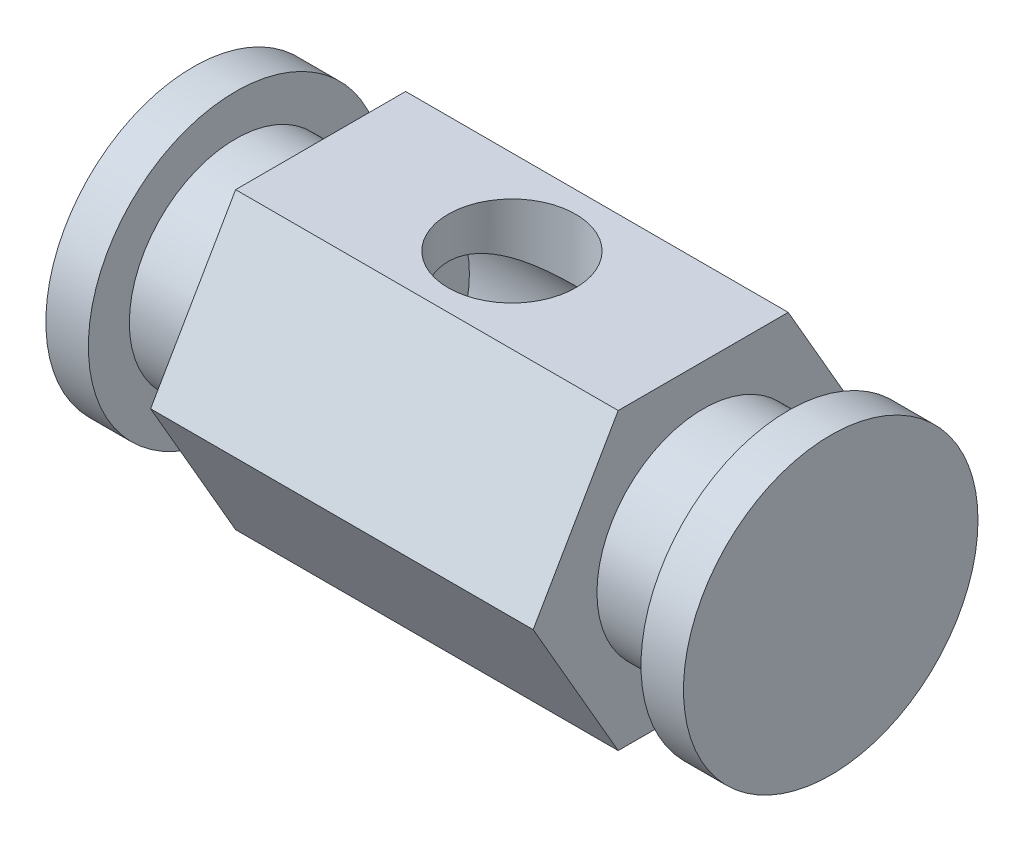
ISO-10303-21;
HEADER;
FILE_DESCRIPTION(('STEP AP214'),'2;1');
FILE_NAME('part.step','',(''),(''),'','','');
FILE_SCHEMA(('AUTOMOTIVE_DESIGN { 1 0 10303 214 1 1 1 1 }'));
ENDSEC;
DATA;
#1=APPLICATION_CONTEXT('core data for automotive mechanical design processes');
#2=APPLICATION_PROTOCOL_DEFINITION('international standard','automotive_design',2000,#1);
#3=PRODUCT_CONTEXT('',#1,'mechanical');
#4=PRODUCT('Part','Part','',(#3));
#5=PRODUCT_RELATED_PRODUCT_CATEGORY('part','',(#4));
#6=PRODUCT_DEFINITION_FORMATION('','',#4);
#7=PRODUCT_DEFINITION_CONTEXT('part definition',#1,'design');
#8=PRODUCT_DEFINITION('design','',#6,#7);
#9=PRODUCT_DEFINITION_SHAPE('','',#8);
#10=(LENGTH_UNIT() NAMED_UNIT(*) SI_UNIT(.MILLI.,.METRE.));
#11=(NAMED_UNIT(*) PLANE_ANGLE_UNIT() SI_UNIT($,.RADIAN.));
#12=(NAMED_UNIT(*) SI_UNIT($,.STERADIAN.) SOLID_ANGLE_UNIT());
#13=UNCERTAINTY_MEASURE_WITH_UNIT(LENGTH_MEASURE(1.E-05),#10,'distance_accuracy_value','');
#14=(GEOMETRIC_REPRESENTATION_CONTEXT(3) GLOBAL_UNCERTAINTY_ASSIGNED_CONTEXT((#13)) GLOBAL_UNIT_ASSIGNED_CONTEXT((#10,
#11,#12)) REPRESENTATION_CONTEXT('',''));
#15=CARTESIAN_POINT('',(0.,0.,0.));
#16=DIRECTION('',(0.,0.,1.));
#17=DIRECTION('',(1.,0.,0.));
#18=AXIS2_PLACEMENT_3D('',#15,#16,#17);
#19=CARTESIAN_POINT('',(22.5,0.,0.));
#20=DIRECTION('',(-1.,0.,0.));
#21=DIRECTION('',(0.,0.,1.));
#22=AXIS2_PLACEMENT_3D('',#19,#20,#21);
#23=CYLINDRICAL_SURFACE('',#22,12.5);
#24=CARTESIAN_POINT('',(17.5,0.,0.));
#25=DIRECTION('',(1.,0.,0.));
#26=DIRECTION('',(0.,0.,-1.));
#27=AXIS2_PLACEMENT_3D('',#24,#25,#26);
#28=CIRCLE('',#27,12.5);
#29=CARTESIAN_POINT('',(17.5,0.,-12.5));
#30=VERTEX_POINT('',#29);
#31=EDGE_CURVE('E210',#30,#30,#28,.T.);
#32=ORIENTED_EDGE('',*,*,#31,.T.);
#33=EDGE_LOOP('',(#32));
#34=FACE_BOUND('',#33,.T.);
#35=CARTESIAN_POINT('',(0.,-10.,7.5));
#36=CARTESIAN_POINT('',(0.188692773104688,-9.99999823078383,7.50000120679242));
#37=CARTESIAN_POINT('',(0.377372231482413,-10.0053601477454,7.49286874148265));
#38=CARTESIAN_POINT('',(0.753055741609481,-10.0265610634639,7.46447502665632));
#39=CARTESIAN_POINT('',(0.940059904060489,-10.0423993646996,7.44321471777582));
#40=CARTESIAN_POINT('',(1.31103429157001,-10.0838875511475,7.38690918482064));
#41=CARTESIAN_POINT('',(1.49500158372569,-10.1095464015261,7.35185136418562));
#42=CARTESIAN_POINT('',(1.85843271331336,-10.1696429705428,7.26849331083707));
#43=CARTESIAN_POINT('',(2.0378963147779,-10.2040811481166,7.22019238583577));
#44=CARTESIAN_POINT('',(2.38994614713429,-10.2802003218269,7.11138858218429));
#45=CARTESIAN_POINT('',(2.56257402518394,-10.3218247593381,7.05098043543781));
#46=CARTESIAN_POINT('',(2.90163367268208,-10.4111819148763,6.9183586416477));
#47=CARTESIAN_POINT('',(3.06806298347129,-10.4589170240795,6.84614037008011));
#48=CARTESIAN_POINT('',(3.5570088898786,-10.6092473794473,6.61272201077553));
#49=CARTESIAN_POINT('',(3.86941771930208,-10.7190214536722,6.43468492430838));
#50=CARTESIAN_POINT('',(4.49983310186811,-10.961457844936,6.01351023928956));
#51=CARTESIAN_POINT('',(4.81385372032728,-11.0952775973879,5.76507448644969));
#52=CARTESIAN_POINT('',(5.25250928504391,-11.2947767726125,5.35733763463461));
#53=CARTESIAN_POINT('',(5.39341905252056,-11.3611173580496,5.21546669500758));
#54=CARTESIAN_POINT('',(5.66389561288898,-11.4919832543935,4.92039993723567));
#55=CARTESIAN_POINT('',(5.79346040775826,-11.5565082441938,4.76720213298469));
#56=CARTESIAN_POINT('',(6.05387736830032,-11.6891210188159,4.43285564137838));
#57=CARTESIAN_POINT('',(6.18334510449195,-11.7568362139061,4.25047753744622));
#58=CARTESIAN_POINT('',(6.42623807951091,-11.8863782053003,3.87346312854206));
#59=CARTESIAN_POINT('',(6.53967045659397,-11.9482076176741,3.67883233406749));
#60=CARTESIAN_POINT('',(6.74929824514343,-12.0642201883362,3.2784164671804));
#61=CARTESIAN_POINT('',(6.84550107726848,-12.1184066362557,3.07263624673865));
#62=CARTESIAN_POINT('',(7.01944969456585,-12.2175104392727,2.65127326533902));
#63=CARTESIAN_POINT('',(7.0971985128734,-12.2624293174459,2.43569212222876));
#64=CARTESIAN_POINT('',(7.2265508104083,-12.3377691728578,2.01747359212342));
#65=CARTESIAN_POINT('',(7.27994111935902,-12.3691645244113,1.81556383007454));
#66=CARTESIAN_POINT('',(7.36985691367482,-12.4222973608661,1.40676725051505));
#67=CARTESIAN_POINT('',(7.40638337680498,-12.4440354056949,1.19988072228908));
#68=CARTESIAN_POINT('',(7.46196289662482,-12.477194920202,0.783116791483749));
#69=CARTESIAN_POINT('',(7.48102963470044,-12.4886244674807,0.573241861806046));
#70=CARTESIAN_POINT('',(7.50141157120872,-12.5008442041257,0.152330680482684));
#71=CARTESIAN_POINT('',(7.50272857571368,-12.5016354759586,-0.0587054508221876));
#72=CARTESIAN_POINT('',(7.48853906892484,-12.4931260267531,-0.453714777156578));
#73=CARTESIAN_POINT('',(7.47510185603572,-12.4850666053635,-0.637793616435806));
#74=CARTESIAN_POINT('',(7.43478376412771,-12.4609689355091,-1.00394655598314));
#75=CARTESIAN_POINT('',(7.40790295021372,-12.4449307256842,-1.18602066595543));
#76=CARTESIAN_POINT('',(7.3410358323648,-12.4052442277447,-1.54689074708866));
#77=CARTESIAN_POINT('',(7.30104970200605,-12.3815960404222,-1.72568676163393));
#78=CARTESIAN_POINT('',(7.20844210361948,-12.3272151907499,-2.07886939421951));
#79=CARTESIAN_POINT('',(7.155820114962,-12.2964822364917,-2.25325583024659));
#80=CARTESIAN_POINT('',(7.03817333792658,-12.2283918721564,-2.59757407732022));
#81=CARTESIAN_POINT('',(6.97308161624169,-12.1909987925766,-2.76747594566571));
#82=CARTESIAN_POINT('',(6.83130799278641,-12.1104656177526,-3.10098446114959));
#83=CARTESIAN_POINT('',(6.7546222287775,-12.0673236079794,-3.26458898762978));
#84=CARTESIAN_POINT('',(6.50814521196327,-11.9305144973489,-3.74477506801769));
#85=CARTESIAN_POINT('',(6.3218550439595,-11.8294173233651,-4.05095816681986));
#86=CARTESIAN_POINT('',(5.88579358864849,-11.6018914143767,-4.66541618539828));
#87=CARTESIAN_POINT('',(5.63109761876534,-11.4738793152295,-4.9695726070298));
#88=CARTESIAN_POINT('',(5.07794018109779,-11.2127575101819,-5.5335940307367));
#89=CARTESIAN_POINT('',(4.77941947736904,-11.0796410878055,-5.7933980391173));
#90=CARTESIAN_POINT('',(4.28409925606161,-10.8778361830914,-6.15997312633097));
#91=CARTESIAN_POINT('',(4.10058958896489,-10.8066538673819,-6.28366126969308));
#92=CARTESIAN_POINT('',(3.72202575670407,-10.6687579062864,-6.51503745890077));
#93=CARTESIAN_POINT('',(3.52696970058253,-10.602044996692,-6.62272287377845));
#94=CARTESIAN_POINT('',(3.12652125290092,-10.4756432504103,-6.82090231570387));
#95=CARTESIAN_POINT('',(2.92114494481455,-10.4159439402154,-6.91142210385062));
#96=CARTESIAN_POINT('',(2.50090829012674,-10.305992775228,-7.07433274728352));
#97=CARTESIAN_POINT('',(2.28605170832038,-10.2557372111069,-7.14673072420734));
#98=CARTESIAN_POINT('',(1.90263340778911,-10.178114111283,-7.25667461828035));
#99=CARTESIAN_POINT('',(1.73578617557886,-10.1481606268142,-7.29841140631324));
#100=CARTESIAN_POINT('',(1.39847645342368,-10.0959398034874,-7.37048077339704));
#101=CARTESIAN_POINT('',(1.22801477044022,-10.0736707677861,-7.40081587024739));
#102=CARTESIAN_POINT('',(0.88467910293567,-10.037606550335,-7.44965633189382));
#103=CARTESIAN_POINT('',(0.711807598531673,-10.0238032320233,-7.4681730562511));
#104=CARTESIAN_POINT('',(0.364704061930949,-10.0051477481708,-7.49314782944574));
#105=CARTESIAN_POINT('',(0.190472000959253,-10.0002957724635,-7.4996056225464));
#106=CARTESIAN_POINT('',(-0.158273249010935,-9.99973014508067,-7.50035982068346));
#107=CARTESIAN_POINT('',(-0.332786495033985,-10.0040290732705,-7.49463948428721));
#108=CARTESIAN_POINT('',(-0.680531944099266,-10.0216248303757,-7.47109423447713));
#109=CARTESIAN_POINT('',(-0.853764140464238,-10.034921706158,-7.45326925801477));
#110=CARTESIAN_POINT('',(-1.1977974129686,-10.0700255654224,-7.40577159941338));
#111=CARTESIAN_POINT('',(-1.36859727685108,-10.0918366483772,-7.37609320986082));
#112=CARTESIAN_POINT('',(-1.70667432339135,-10.1432145107887,-7.30527949826134));
#113=CARTESIAN_POINT('',(-1.8739500378864,-10.172784456172,-7.26413949899432));
#114=CARTESIAN_POINT('',(-2.20374031188016,-10.2386720947097,-7.17097191379845));
#115=CARTESIAN_POINT('',(-2.36626272005138,-10.274977841261,-7.1189635835979));
#116=CARTESIAN_POINT('',(-2.68619223147815,-10.3533352508685,-7.00451682931186));
#117=CARTESIAN_POINT('',(-2.8435976378413,-10.3953887964191,-6.94207498659024));
#118=CARTESIAN_POINT('',(-3.30723467778529,-10.5285418463914,-6.73987072741965));
#119=CARTESIAN_POINT('',(-3.60504547886708,-10.6266672038671,-6.58518422132203));
#120=CARTESIAN_POINT('',(-4.22628250436646,-10.8518645415799,-6.20832715462771));
#121=CARTESIAN_POINT('',(-4.54464774892117,-10.9809658731543,-5.9790180424004));
#122=CARTESIAN_POINT('',(-4.99214330661705,-11.1760249043361,-5.60060254239724));
#123=CARTESIAN_POINT('',(-5.13640074272676,-11.2413306806479,-5.46860539765543));
#124=CARTESIAN_POINT('',(-5.41443062347967,-11.3710562458251,-5.19347495646691));
#125=CARTESIAN_POINT('',(-5.54820120771097,-11.4354758758204,-5.05033969300513));
#126=CARTESIAN_POINT('',(-5.82131514437674,-11.5702992750371,-4.73407411681794));
#127=CARTESIAN_POINT('',(-5.95910849863414,-11.6403872249459,-4.55946685321339));
#128=CARTESIAN_POINT('',(-6.21936179384066,-11.7757426572854,-4.19752243251675));
#129=CARTESIAN_POINT('',(-6.34182793854949,-11.8410120856195,-4.01019047347924));
#130=CARTESIAN_POINT('',(-6.57031577035696,-11.9649421100263,-3.62371710093581));
#131=CARTESIAN_POINT('',(-6.67634116026973,-12.0236041933995,-3.4245783605802));
#132=CARTESIAN_POINT('',(-6.87072708731596,-12.1326177402039,-3.0156810985293));
#133=CARTESIAN_POINT('',(-6.95909003276554,-12.1829703364898,-2.80592402956304));
#134=CARTESIAN_POINT('',(-7.1111773112232,-12.2705038668088,-2.39290771317297));
#135=CARTESIAN_POINT('',(-7.17622475903736,-12.308375712443,-2.19028248858964));
#136=CARTESIAN_POINT('',(-7.28913769564021,-12.3745477559289,-1.778758838461));
#137=CARTESIAN_POINT('',(-7.3370038235628,-12.4028483098242,-1.56986064657932));
#138=CARTESIAN_POINT('',(-7.41475182068993,-12.4489985951498,-1.14780479520938));
#139=CARTESIAN_POINT('',(-7.44465062820149,-12.4668581691577,-0.934651343809274));
#140=CARTESIAN_POINT('',(-7.48601236995236,-12.4916012697912,-0.505939659922356));
#141=CARTESIAN_POINT('',(-7.49747770748443,-12.4984862272487,-0.290381744611884));
#142=CARTESIAN_POINT('',(-7.50149083731495,-12.5008948532131,0.112151821569249));
#143=CARTESIAN_POINT('',(-7.49635999809251,-12.4978126770678,0.299101086082838));
#144=CARTESIAN_POINT('',(-7.47218709467063,-12.4833282510086,0.671773742150895));
#145=CARTESIAN_POINT('',(-7.45314537944419,-12.4719262098097,0.857497164339332));
#146=CARTESIAN_POINT('',(-7.40140400507448,-12.4410751634198,1.22633646290172));
#147=CARTESIAN_POINT('',(-7.36870500971334,-12.4216265493153,1.40945246555634));
#148=CARTESIAN_POINT('',(-7.29006169982175,-12.3751361717483,1.77183006760248));
#149=CARTESIAN_POINT('',(-7.24411698832095,-12.3480941807152,1.9510915513021));
#150=CARTESIAN_POINT('',(-7.14036425079735,-12.2875162258367,2.30175557439519));
#151=CARTESIAN_POINT('',(-7.08276181686451,-12.2540933057182,2.47323858855957));
#152=CARTESIAN_POINT('',(-6.95583265831419,-12.1811708599912,2.81049732306679));
#153=CARTESIAN_POINT('',(-6.88650213772686,-12.1416693673375,2.97627117457875));
#154=CARTESIAN_POINT('',(-6.66186004706047,-12.0151967745144,3.46373719515787));
#155=CARTESIAN_POINT('',(-6.48982400648675,-11.9202132953099,3.7758204727761));
#156=CARTESIAN_POINT('',(-6.08534983857752,-11.7046609545403,4.401374151397));
#157=CARTESIAN_POINT('',(-5.84838193641815,-11.5824339466914,4.7113171053629));
#158=CARTESIAN_POINT('',(-5.33125937723798,-11.3301036620341,5.28946389728756));
#159=CARTESIAN_POINT('',(-5.05105687747664,-11.1999917579732,5.55762082660486));
#160=CARTESIAN_POINT('',(-4.41348879871702,-10.9263829364944,6.07959239913489));
#161=CARTESIAN_POINT('',(-4.05084402361769,-10.7832810292532,6.32727585963683));
#162=CARTESIAN_POINT('',(-3.47462714205365,-10.5849217173034,6.65022773867512));
#163=CARTESIAN_POINT('',(-3.27711979225767,-10.5215019916803,6.74980398536693));
#164=CARTESIAN_POINT('',(-2.87201477324607,-10.4024521257067,6.93186784584636));
#165=CARTESIAN_POINT('',(-2.66441725456022,-10.3468218691974,7.01435571446969));
#166=CARTESIAN_POINT('',(-2.25848300148507,-10.2501351559249,7.15481558011699));
#167=CARTESIAN_POINT('',(-2.06086076902219,-10.2082415060397,7.21427616671245));
#168=CARTESIAN_POINT('',(-1.65965877490963,-10.1348719640507,7.31699130623615));
#169=CARTESIAN_POINT('',(-1.45608299276073,-10.103389278735,7.36025642923621));
#170=CARTESIAN_POINT('',(-1.04488685636496,-10.0523754060515,7.42977906555983));
#171=CARTESIAN_POINT('',(-0.837273411131533,-10.0328253876625,7.45606338026241));
#172=CARTESIAN_POINT('',(-0.419767626510736,-10.0066394811847,7.49117207766574));
#173=CARTESIAN_POINT('',(-0.209875577270451,-10.0000019678298,7.49999865773208));
#174=CARTESIAN_POINT('',(0.,-10.,7.5));
#175=B_SPLINE_CURVE_WITH_KNOTS('',3,(#35,#36,#37,#38,#39,#40,#41,#42,#43,#44,#45,#46,#47,#48,
#49,#50,#51,#52,#53,#54,#55,#56,#57,#58,#59,#60,#61,#62,#63,#64,#65,#66,#67,#68,#69,#70,#71,#72,
#73,#74,#75,#76,#77,#78,#79,#80,#81,#82,#83,#84,#85,#86,#87,#88,#89,#90,#91,#92,#93,#94,#95,#96,
#97,#98,#99,#100,#101,#102,#103,#104,#105,#106,#107,#108,#109,#110,#111,#112,#113,#114,#115,
#116,#117,#118,#119,#120,#121,#122,#123,#124,#125,#126,#127,#128,#129,#130,#131,#132,#133,#134,
#135,#136,#137,#138,#139,#140,#141,#142,#143,#144,#145,#146,#147,#148,#149,#150,#151,#152,#153,
#154,#155,#156,#157,#158,#159,#160,#161,#162,#163,#164,#165,#166,#167,#168,#169,#170,#171,#172,
#173,#174),.UNSPECIFIED.,.T.,.F.,(4,2,2,2,2,2,2,2,2,2,2,2,2,2,2,2,2,2,2,2,2,2,2,2,2,2,2,2,2,2,2,
2,2,2,2,2,2,2,2,2,2,2,2,2,2,2,2,2,2,2,2,2,2,2,2,2,2,2,2,2,2,2,2,2,2,2,2,2,2,4),(0.,
0.565847664941352,1.13165765934977,1.69798541775812,2.26434278678839,2.82643055762257,
3.38873895609719,4.51260964228029,5.77389395070291,6.40541950298795,7.03705605377578,
7.73719785519436,8.43702699531025,9.13655399467041,9.83596593876093,10.4686435438572,
11.101284461724,11.7334292188741,12.3655096534955,12.9190805875071,13.4726488407014,
14.026209762338,14.5797934960143,15.1364364428117,15.6932652302445,16.8061898968696,
18.052047981167,19.2996058111948,19.9962788030126,20.6930662066484,21.3887994932595,
22.0842589348901,22.6074630613155,23.1305515822502,23.6531365617513,24.1757326237138,
24.6990475691323,25.222365240323,25.7459351931216,26.2697191165561,26.7925827878468,
27.3156181173834,28.3611893568746,29.5952538232474,30.2132528522665,30.8313612699863,
31.5301138305572,32.2285826467617,32.9268939234563,33.625109918705,34.2726300267248,
34.920126044922,35.5670106885767,36.2138109867834,36.774254703411,37.3346843610389,
37.895086783382,38.4555060025722,39.006789842679,39.5582524566087,40.6604022169002,
41.8822021246453,43.1053638842687,44.4836387355011,45.1731642163991,45.8626794137954,
46.4935387877718,47.1239857065273,47.7534351229369,48.3828053069281),.UNSPECIFIED.);
#176=CARTESIAN_POINT('',(0.,-10.,7.5));
#177=VERTEX_POINT('',#176);
#178=EDGE_CURVE('E38',#177,#177,#175,.T.);
#179=ORIENTED_EDGE('',*,*,#178,.F.);
#180=EDGE_LOOP('',(#179));
#181=FACE_BOUND('',#180,.T.);
#182=CARTESIAN_POINT('',(0.,10.,7.5));
#183=CARTESIAN_POINT('',(-0.188692773104688,9.99999823078383,7.50000120679242));
#184=CARTESIAN_POINT('',(-0.377372231482413,10.0053601477454,7.49286874148265));
#185=CARTESIAN_POINT('',(-0.753055741609481,10.0265610634639,7.46447502665632));
#186=CARTESIAN_POINT('',(-0.940059904060488,10.0423993646996,7.44321471777582));
#187=CARTESIAN_POINT('',(-1.31103429157001,10.0838875511475,7.38690918482064));
#188=CARTESIAN_POINT('',(-1.49500158372569,10.1095464015261,7.35185136418562));
#189=CARTESIAN_POINT('',(-1.85843271331336,10.1696429705428,7.26849331083707));
#190=CARTESIAN_POINT('',(-2.0378963147779,10.2040811481166,7.22019238583578));
#191=CARTESIAN_POINT('',(-2.38994614713428,10.2802003218269,7.1113885821843));
#192=CARTESIAN_POINT('',(-2.56257402518393,10.3218247593381,7.05098043543782));
#193=CARTESIAN_POINT('',(-2.90163367268208,10.4111819148763,6.9183586416477));
#194=CARTESIAN_POINT('',(-3.06806298347128,10.4589170240795,6.84614037008012));
#195=CARTESIAN_POINT('',(-3.5570088898786,10.6092473794473,6.61272201077553));
#196=CARTESIAN_POINT('',(-3.86941771930208,10.7190214536722,6.43468492430838));
#197=CARTESIAN_POINT('',(-4.4998331018681,10.961457844936,6.01351023928957));
#198=CARTESIAN_POINT('',(-4.81385372032728,11.0952775973879,5.7650744864497));
#199=CARTESIAN_POINT('',(-5.25250928504391,11.2947767726125,5.35733763463462));
#200=CARTESIAN_POINT('',(-5.39341905252056,11.3611173580496,5.21546669500759));
#201=CARTESIAN_POINT('',(-5.66389561288898,11.4919832543935,4.92039993723567));
#202=CARTESIAN_POINT('',(-5.79346040775825,11.5565082441938,4.7672021329847));
#203=CARTESIAN_POINT('',(-6.05387736830032,11.6891210188159,4.43285564137839));
#204=CARTESIAN_POINT('',(-6.18334510449195,11.7568362139061,4.25047753744623));
#205=CARTESIAN_POINT('',(-6.4262380795109,11.8863782053003,3.87346312854207));
#206=CARTESIAN_POINT('',(-6.53967045659396,11.9482076176741,3.6788323340675));
#207=CARTESIAN_POINT('',(-6.74929824514343,12.0642201883362,3.27841646718041));
#208=CARTESIAN_POINT('',(-6.84550107726848,12.1184066362557,3.07263624673866));
#209=CARTESIAN_POINT('',(-7.01944969456585,12.2175104392727,2.65127326533903));
#210=CARTESIAN_POINT('',(-7.0971985128734,12.2624293174459,2.43569212222877));
#211=CARTESIAN_POINT('',(-7.2265508104083,12.3377691728578,2.01747359212343));
#212=CARTESIAN_POINT('',(-7.27994111935902,12.3691645244113,1.81556383007455));
#213=CARTESIAN_POINT('',(-7.36985691367482,12.4222973608661,1.40676725051506));
#214=CARTESIAN_POINT('',(-7.40638337680498,12.4440354056949,1.19988072228909));
#215=CARTESIAN_POINT('',(-7.46196289662482,12.477194920202,0.783116791483759));
#216=CARTESIAN_POINT('',(-7.48102963470043,12.4886244674807,0.573241861806056));
#217=CARTESIAN_POINT('',(-7.50141157120872,12.5008442041257,0.152330680482695));
#218=CARTESIAN_POINT('',(-7.50272857571368,12.5016354759586,-0.0587054508221778));
#219=CARTESIAN_POINT('',(-7.48853906892484,12.4931260267531,-0.453714777156568));
#220=CARTESIAN_POINT('',(-7.47510185603573,12.4850666053635,-0.637793616435796));
#221=CARTESIAN_POINT('',(-7.43478376412771,12.4609689355091,-1.00394655598314));
#222=CARTESIAN_POINT('',(-7.40790295021372,12.4449307256842,-1.18602066595542));
#223=CARTESIAN_POINT('',(-7.3410358323648,12.4052442277447,-1.54689074708866));
#224=CARTESIAN_POINT('',(-7.30104970200605,12.3815960404222,-1.72568676163393));
#225=CARTESIAN_POINT('',(-7.20844210361948,12.3272151907499,-2.0788693942195));
#226=CARTESIAN_POINT('',(-7.155820114962,12.2964822364917,-2.25325583024658));
#227=CARTESIAN_POINT('',(-7.03817333792658,12.2283918721564,-2.59757407732021));
#228=CARTESIAN_POINT('',(-6.97308161624169,12.1909987925766,-2.76747594566571));
#229=CARTESIAN_POINT('',(-6.83130799278642,12.1104656177526,-3.10098446114958));
#230=CARTESIAN_POINT('',(-6.7546222287775,12.0673236079794,-3.26458898762977));
#231=CARTESIAN_POINT('',(-6.50814521196328,11.9305144973489,-3.74477506801769));
#232=CARTESIAN_POINT('',(-6.3218550439595,11.8294173233651,-4.05095816681985));
#233=CARTESIAN_POINT('',(-5.8857935886485,11.6018914143767,-4.66541618539827));
#234=CARTESIAN_POINT('',(-5.63109761876534,11.4738793152295,-4.96957260702979));
#235=CARTESIAN_POINT('',(-5.0779401810978,11.2127575101819,-5.5335940307367));
#236=CARTESIAN_POINT('',(-4.77941947736905,11.0796410878055,-5.79339803911729));
#237=CARTESIAN_POINT('',(-4.28409925606161,10.8778361830914,-6.15997312633096));
#238=CARTESIAN_POINT('',(-4.1005895889649,10.8066538673819,-6.28366126969308));
#239=CARTESIAN_POINT('',(-3.72202575670408,10.6687579062864,-6.51503745890076));
#240=CARTESIAN_POINT('',(-3.52696970058254,10.602044996692,-6.62272287377845));
#241=CARTESIAN_POINT('',(-3.12652125290092,10.4756432504103,-6.82090231570386));
#242=CARTESIAN_POINT('',(-2.92114494481456,10.4159439402154,-6.91142210385062));
#243=CARTESIAN_POINT('',(-2.50090829012675,10.305992775228,-7.07433274728351));
#244=CARTESIAN_POINT('',(-2.28605170832039,10.2557372111069,-7.14673072420734));
#245=CARTESIAN_POINT('',(-1.90263340778912,10.178114111283,-7.25667461828035));
#246=CARTESIAN_POINT('',(-1.73578617557887,10.1481606268142,-7.29841140631324));
#247=CARTESIAN_POINT('',(-1.3984764534237,10.0959398034874,-7.37048077339703));
#248=CARTESIAN_POINT('',(-1.22801477044023,10.0736707677861,-7.40081587024738));
#249=CARTESIAN_POINT('',(-0.88467910293568,10.0376065503351,-7.44965633189382));
#250=CARTESIAN_POINT('',(-0.711807598531683,10.0238032320233,-7.4681730562511));
#251=CARTESIAN_POINT('',(-0.36470406193096,10.0051477481708,-7.49314782944574));
#252=CARTESIAN_POINT('',(-0.190472000959263,10.0002957724635,-7.4996056225464));
#253=CARTESIAN_POINT('',(0.158273249010925,9.99973014508067,-7.50035982068346));
#254=CARTESIAN_POINT('',(0.332786495033975,10.0040290732705,-7.49463948428721));
#255=CARTESIAN_POINT('',(0.680531944099254,10.0216248303757,-7.47109423447713));
#256=CARTESIAN_POINT('',(0.853764140464226,10.034921706158,-7.45326925801477));
#257=CARTESIAN_POINT('',(1.19779741296858,10.0700255654224,-7.40577159941338));
#258=CARTESIAN_POINT('',(1.36859727685107,10.0918366483772,-7.37609320986082));
#259=CARTESIAN_POINT('',(1.70667432339134,10.1432145107887,-7.30527949826135));
#260=CARTESIAN_POINT('',(1.87395003788639,10.172784456172,-7.26413949899432));
#261=CARTESIAN_POINT('',(2.20374031188015,10.2386720947097,-7.17097191379845));
#262=CARTESIAN_POINT('',(2.36626272005137,10.274977841261,-7.1189635835979));
#263=CARTESIAN_POINT('',(2.68619223147814,10.3533352508685,-7.00451682931186));
#264=CARTESIAN_POINT('',(2.84359763784129,10.3953887964191,-6.94207498659025));
#265=CARTESIAN_POINT('',(3.30723467778528,10.5285418463914,-6.73987072741965));
#266=CARTESIAN_POINT('',(3.60504547886707,10.6266672038671,-6.58518422132204));
#267=CARTESIAN_POINT('',(4.22628250436645,10.8518645415799,-6.20832715462772));
#268=CARTESIAN_POINT('',(4.54464774892116,10.9809658731543,-5.9790180424004));
#269=CARTESIAN_POINT('',(4.99214330661704,11.1760249043361,-5.60060254239724));
#270=CARTESIAN_POINT('',(5.13640074272675,11.2413306806479,-5.46860539765543));
#271=CARTESIAN_POINT('',(5.41443062347967,11.3710562458251,-5.19347495646691));
#272=CARTESIAN_POINT('',(5.54820120771097,11.4354758758204,-5.05033969300514));
#273=CARTESIAN_POINT('',(5.82131514437674,11.5702992750371,-4.73407411681794));
#274=CARTESIAN_POINT('',(5.95910849863413,11.6403872249459,-4.5594668532134));
#275=CARTESIAN_POINT('',(6.21936179384066,11.7757426572854,-4.19752243251676));
#276=CARTESIAN_POINT('',(6.34182793854949,11.8410120856195,-4.01019047347925));
#277=CARTESIAN_POINT('',(6.57031577035696,11.9649421100263,-3.62371710093582));
#278=CARTESIAN_POINT('',(6.67634116026972,12.0236041933995,-3.4245783605802));
#279=CARTESIAN_POINT('',(6.87072708731595,12.1326177402039,-3.0156810985293));
#280=CARTESIAN_POINT('',(6.95909003276554,12.1829703364898,-2.80592402956305));
#281=CARTESIAN_POINT('',(7.1111773112232,12.2705038668088,-2.39290771317298));
#282=CARTESIAN_POINT('',(7.17622475903735,12.308375712443,-2.19028248858965));
#283=CARTESIAN_POINT('',(7.2891376956402,12.3745477559289,-1.77875883846101));
#284=CARTESIAN_POINT('',(7.3370038235628,12.4028483098242,-1.56986064657933));
#285=CARTESIAN_POINT('',(7.41475182068993,12.4489985951498,-1.14780479520938));
#286=CARTESIAN_POINT('',(7.44465062820149,12.4668581691577,-0.934651343809283));
#287=CARTESIAN_POINT('',(7.48601236995236,12.4916012697912,-0.505939659922366));
#288=CARTESIAN_POINT('',(7.49747770748443,12.4984862272487,-0.290381744611894));
#289=CARTESIAN_POINT('',(7.50149083731495,12.5008948532131,0.112151821569239));
#290=CARTESIAN_POINT('',(7.4963599980925,12.4978126770678,0.299101086082827));
#291=CARTESIAN_POINT('',(7.47218709467063,12.4833282510086,0.671773742150885));
#292=CARTESIAN_POINT('',(7.45314537944419,12.4719262098097,0.857497164339321));
#293=CARTESIAN_POINT('',(7.40140400507448,12.4410751634198,1.22633646290171));
#294=CARTESIAN_POINT('',(7.36870500971334,12.4216265493153,1.40945246555633));
#295=CARTESIAN_POINT('',(7.29006169982175,12.3751361717483,1.77183006760247));
#296=CARTESIAN_POINT('',(7.24411698832095,12.3480941807152,1.95109155130209));
#297=CARTESIAN_POINT('',(7.14036425079735,12.2875162258367,2.30175557439518));
#298=CARTESIAN_POINT('',(7.08276181686451,12.2540933057182,2.47323858855956));
#299=CARTESIAN_POINT('',(6.95583265831419,12.1811708599912,2.81049732306679));
#300=CARTESIAN_POINT('',(6.88650213772687,12.1416693673375,2.97627117457874));
#301=CARTESIAN_POINT('',(6.66186004706047,12.0151967745144,3.46373719515786));
#302=CARTESIAN_POINT('',(6.48982400648675,11.9202132953099,3.77582047277609));
#303=CARTESIAN_POINT('',(6.08534983857753,11.7046609545403,4.40137415139699));
#304=CARTESIAN_POINT('',(5.84838193641816,11.5824339466914,4.71131710536289));
#305=CARTESIAN_POINT('',(5.33125937723799,11.3301036620341,5.28946389728755));
#306=CARTESIAN_POINT('',(5.05105687747665,11.1999917579732,5.55762082660485));
#307=CARTESIAN_POINT('',(4.41348879871703,10.9263829364944,6.07959239913488));
#308=CARTESIAN_POINT('',(4.0508440236177,10.7832810292532,6.32727585963683));
#309=CARTESIAN_POINT('',(3.47462714205367,10.5849217173034,6.65022773867511));
#310=CARTESIAN_POINT('',(3.27711979225769,10.5215019916803,6.74980398536692));
#311=CARTESIAN_POINT('',(2.87201477324609,10.4024521257067,6.93186784584635));
#312=CARTESIAN_POINT('',(2.66441725456023,10.3468218691974,7.01435571446968));
#313=CARTESIAN_POINT('',(2.25848300148508,10.2501351559249,7.15481558011699));
#314=CARTESIAN_POINT('',(2.06086076902221,10.2082415060397,7.21427616671245));
#315=CARTESIAN_POINT('',(1.65965877490964,10.1348719640507,7.31699130623615));
#316=CARTESIAN_POINT('',(1.45608299276074,10.103389278735,7.3602564292362));
#317=CARTESIAN_POINT('',(1.04488685636497,10.0523754060515,7.42977906555983));
#318=CARTESIAN_POINT('',(0.837273411131539,10.0328253876624,7.45606338026241));
#319=CARTESIAN_POINT('',(0.419767626510737,10.0066394811847,7.49117207766574));
#320=CARTESIAN_POINT('',(0.209875577270451,10.0000019678298,7.49999865773208));
#321=CARTESIAN_POINT('',(0.,10.,7.5));
#322=B_SPLINE_CURVE_WITH_KNOTS('',3,(#182,#183,#184,#185,#186,#187,#188,#189,#190,#191,#192,
#193,#194,#195,#196,#197,#198,#199,#200,#201,#202,#203,#204,#205,#206,#207,#208,#209,#210,#211,
#212,#213,#214,#215,#216,#217,#218,#219,#220,#221,#222,#223,#224,#225,#226,#227,#228,#229,#230,
#231,#232,#233,#234,#235,#236,#237,#238,#239,#240,#241,#242,#243,#244,#245,#246,#247,#248,#249,
#250,#251,#252,#253,#254,#255,#256,#257,#258,#259,#260,#261,#262,#263,#264,#265,#266,#267,#268,
#269,#270,#271,#272,#273,#274,#275,#276,#277,#278,#279,#280,#281,#282,#283,#284,#285,#286,#287,
#288,#289,#290,#291,#292,#293,#294,#295,#296,#297,#298,#299,#300,#301,#302,#303,#304,#305,#306,
#307,#308,#309,#310,#311,#312,#313,#314,#315,#316,#317,#318,#319,#320,#321),.UNSPECIFIED.,.T.,
.F.,(4,2,2,2,2,2,2,2,2,2,2,2,2,2,2,2,2,2,2,2,2,2,2,2,2,2,2,2,2,2,2,2,2,2,2,2,2,2,2,2,2,2,2,2,2,
2,2,2,2,2,2,2,2,2,2,2,2,2,2,2,2,2,2,2,2,2,2,2,2,4),(0.,0.565847664941352,1.13165765934976,
1.69798541775812,2.26434278678838,2.82643055762257,3.38873895609718,4.51260964228029,
5.7738939507029,6.40541950298794,7.03705605377577,7.73719785519435,8.43702699531023,
9.13655399467039,9.83596593876092,10.4686435438572,11.101284461724,11.7334292188741,
12.3655096534955,12.9190805875071,13.4726488407014,14.026209762338,14.5797934960143,
15.1364364428117,15.6932652302445,16.8061898968696,18.052047981167,19.2996058111948,
19.9962788030126,20.6930662066484,21.3887994932595,22.0842589348901,22.6074630613155,
23.1305515822501,23.6531365617513,24.1757326237138,24.6990475691323,25.222365240323,
25.7459351931216,26.269719116556,26.7925827878467,27.3156181173834,28.3611893568746,
29.5952538232474,30.2132528522664,30.8313612699863,31.5301138305572,32.2285826467617,
32.9268939234562,33.6251099187049,34.2726300267248,34.920126044922,35.5670106885767,
36.2138109867834,36.774254703411,37.3346843610389,37.895086783382,38.4555060025722,
39.006789842679,39.5582524566087,40.6604022169001,41.8822021246453,43.1053638842686,
44.4836387355011,45.1731642163991,45.8626794137954,46.4935387877718,47.1239857065273,
47.7534351229369,48.3828053069281),.UNSPECIFIED.);
#323=CARTESIAN_POINT('',(0.,10.,7.5));
#324=VERTEX_POINT('',#323);
#325=EDGE_CURVE('E143',#324,#324,#322,.T.);
#326=ORIENTED_EDGE('',*,*,#325,.F.);
#327=EDGE_LOOP('',(#326));
#328=FACE_BOUND('',#327,.T.);
#329=CARTESIAN_POINT('',(-17.5,0.,0.));
#330=DIRECTION('',(1.,0.,0.));
#331=DIRECTION('',(0.,0.,-1.));
#332=AXIS2_PLACEMENT_3D('',#329,#330,#331);
#333=CIRCLE('',#332,12.5);
#334=CARTESIAN_POINT('',(-17.5,0.,-12.5));
#335=VERTEX_POINT('',#334);
#336=EDGE_CURVE('E218',#335,#335,#333,.T.);
#337=ORIENTED_EDGE('',*,*,#336,.F.);
#338=EDGE_LOOP('',(#337));
#339=FACE_BOUND('',#338,.T.);
#340=ADVANCED_FACE('F34',(#34,#181,#328,#339),#23,.F.);
#341=CARTESIAN_POINT('',(22.5,0.,0.));
#342=DIRECTION('',(1.,0.,0.));
#343=DIRECTION('',(0.,0.,-1.));
#344=AXIS2_PLACEMENT_3D('',#341,#342,#343);
#345=PLANE('',#344);
#346=DIRECTION('',(0.,0.866025403784438,0.5));
#347=VECTOR('',#346,1.);
#348=CARTESIAN_POINT('',(22.5,0.,-20.));
#349=LINE('',#348,#347);
#350=CARTESIAN_POINT('',(22.5,0.,-20.));
#351=VERTEX_POINT('',#350);
#352=CARTESIAN_POINT('',(22.5,17.3205080756888,-10.));
#353=VERTEX_POINT('',#352);
#354=EDGE_CURVE('E138',#351,#353,#349,.T.);
#355=ORIENTED_EDGE('',*,*,#354,.T.);
#356=DIRECTION('',(0.,0.,1.));
#357=VECTOR('',#356,1.);
#358=CARTESIAN_POINT('',(22.5,17.3205080756888,-10.));
#359=LINE('',#358,#357);
#360=CARTESIAN_POINT('',(22.5,17.3205080756888,10.));
#361=VERTEX_POINT('',#360);
#362=EDGE_CURVE('E95',#353,#361,#359,.T.);
#363=ORIENTED_EDGE('',*,*,#362,.T.);
#364=DIRECTION('',(0.,-0.866025403784439,0.5));
#365=VECTOR('',#364,1.);
#366=CARTESIAN_POINT('',(22.5,17.3205080756888,10.));
#367=LINE('',#366,#365);
#368=CARTESIAN_POINT('',(22.5,0.,20.));
#369=VERTEX_POINT('',#368);
#370=EDGE_CURVE('E109',#361,#369,#367,.T.);
#371=ORIENTED_EDGE('',*,*,#370,.T.);
#372=DIRECTION('',(0.,-0.866025403784438,-0.5));
#373=VECTOR('',#372,1.);
#374=CARTESIAN_POINT('',(22.5,0.,20.));
#375=LINE('',#374,#373);
#376=CARTESIAN_POINT('',(22.5,-17.3205080756888,9.99999999999999));
#377=VERTEX_POINT('',#376);
#378=EDGE_CURVE('E102',#369,#377,#375,.T.);
#379=ORIENTED_EDGE('',*,*,#378,.T.);
#380=DIRECTION('',(0.,0.,-1.));
#381=VECTOR('',#380,1.);
#382=CARTESIAN_POINT('',(22.5,-17.3205080756888,9.99999999999999));
#383=LINE('',#382,#381);
#384=CARTESIAN_POINT('',(22.5,-17.3205080756888,-10.));
#385=VERTEX_POINT('',#384);
#386=EDGE_CURVE('E107',#377,#385,#383,.T.);
#387=ORIENTED_EDGE('',*,*,#386,.T.);
#388=DIRECTION('',(0.,0.866025403784439,-0.5));
#389=VECTOR('',#388,1.);
#390=CARTESIAN_POINT('',(22.5,-17.3205080756888,-10.));
#391=LINE('',#390,#389);
#392=EDGE_CURVE('E58',#385,#351,#391,.T.);
#393=ORIENTED_EDGE('',*,*,#392,.T.);
#394=EDGE_LOOP('',(#355,#363,#371,#379,#387,#393));
#395=FACE_BOUND('',#394,.T.);
#396=CARTESIAN_POINT('',(22.5,0.,0.));
#397=DIRECTION('',(1.,0.,0.));
#398=DIRECTION('',(0.,0.,-1.));
#399=AXIS2_PLACEMENT_3D('',#396,#397,#398);
#400=CIRCLE('',#399,12.5);
#401=CARTESIAN_POINT('',(22.5,0.,-12.5));
#402=VERTEX_POINT('',#401);
#403=EDGE_CURVE('E131',#402,#402,#400,.T.);
#404=ORIENTED_EDGE('',*,*,#403,.F.);
#405=EDGE_LOOP('',(#404));
#406=FACE_BOUND('',#405,.T.);
#407=ADVANCED_FACE('F104',(#395,#406),#345,.T.);
#408=CARTESIAN_POINT('',(-22.5,0.,0.));
#409=DIRECTION('',(1.,0.,0.));
#410=DIRECTION('',(0.,0.,-1.));
#411=AXIS2_PLACEMENT_3D('',#408,#409,#410);
#412=PLANE('',#411);
#413=DIRECTION('',(0.,0.866025403784438,0.5));
#414=VECTOR('',#413,1.);
#415=CARTESIAN_POINT('',(-22.5,0.,-20.));
#416=LINE('',#415,#414);
#417=CARTESIAN_POINT('',(-22.5,0.,-20.));
#418=VERTEX_POINT('',#417);
#419=CARTESIAN_POINT('',(-22.5,17.3205080756888,-10.));
#420=VERTEX_POINT('',#419);
#421=EDGE_CURVE('E127',#418,#420,#416,.T.);
#422=ORIENTED_EDGE('',*,*,#421,.F.);
#423=DIRECTION('',(0.,0.866025403784439,-0.5));
#424=VECTOR('',#423,1.);
#425=CARTESIAN_POINT('',(-22.5,-17.3205080756888,-10.));
#426=LINE('',#425,#424);
#427=CARTESIAN_POINT('',(-22.5,-17.3205080756888,-10.));
#428=VERTEX_POINT('',#427);
#429=EDGE_CURVE('E87',#428,#418,#426,.T.);
#430=ORIENTED_EDGE('',*,*,#429,.F.);
#431=DIRECTION('',(0.,0.,-1.));
#432=VECTOR('',#431,1.);
#433=CARTESIAN_POINT('',(-22.5,-17.3205080756888,9.99999999999999));
#434=LINE('',#433,#432);
#435=CARTESIAN_POINT('',(-22.5,-17.3205080756888,9.99999999999999));
#436=VERTEX_POINT('',#435);
#437=EDGE_CURVE('E81',#436,#428,#434,.T.);
#438=ORIENTED_EDGE('',*,*,#437,.F.);
#439=DIRECTION('',(0.,-0.866025403784438,-0.5));
#440=VECTOR('',#439,1.);
#441=CARTESIAN_POINT('',(-22.5,0.,20.));
#442=LINE('',#441,#440);
#443=CARTESIAN_POINT('',(-22.5,0.,20.));
#444=VERTEX_POINT('',#443);
#445=EDGE_CURVE('E117',#444,#436,#442,.T.);
#446=ORIENTED_EDGE('',*,*,#445,.F.);
#447=DIRECTION('',(0.,-0.866025403784439,0.5));
#448=VECTOR('',#447,1.);
#449=CARTESIAN_POINT('',(-22.5,17.3205080756888,10.));
#450=LINE('',#449,#448);
#451=CARTESIAN_POINT('',(-22.5,17.3205080756888,10.));
#452=VERTEX_POINT('',#451);
#453=EDGE_CURVE('E133',#452,#444,#450,.T.);
#454=ORIENTED_EDGE('',*,*,#453,.F.);
#455=DIRECTION('',(0.,0.,1.));
#456=VECTOR('',#455,1.);
#457=CARTESIAN_POINT('',(-22.5,17.3205080756888,-10.));
#458=LINE('',#457,#456);
#459=EDGE_CURVE('E130',#420,#452,#458,.T.);
#460=ORIENTED_EDGE('',*,*,#459,.F.);
#461=EDGE_LOOP('',(#422,#430,#438,#446,#454,#460));
#462=FACE_BOUND('',#461,.T.);
#463=CARTESIAN_POINT('',(-22.5,0.,0.));
#464=DIRECTION('',(1.,0.,0.));
#465=DIRECTION('',(0.,0.,-1.));
#466=AXIS2_PLACEMENT_3D('',#463,#464,#465);
#467=CIRCLE('',#466,12.5);
#468=CARTESIAN_POINT('',(-22.5,0.,-12.5));
#469=VERTEX_POINT('',#468);
#470=EDGE_CURVE('E219',#469,#469,#467,.F.);
#471=ORIENTED_EDGE('',*,*,#470,.F.);
#472=EDGE_LOOP('',(#471));
#473=FACE_BOUND('',#472,.T.);
#474=ADVANCED_FACE('F206',(#462,#473),#412,.F.);
#475=CARTESIAN_POINT('',(22.5,0.,-20.));
#476=DIRECTION('',(0.,-0.5,0.866025403784438));
#477=DIRECTION('',(0.,-0.866025403784439,-0.5));
#478=AXIS2_PLACEMENT_3D('',#475,#476,#477);
#479=PLANE('',#478);
#480=ORIENTED_EDGE('',*,*,#421,.T.);
#481=DIRECTION('',(-1.,0.,0.));
#482=VECTOR('',#481,1.);
#483=CARTESIAN_POINT('',(22.5,17.3205080756888,-10.));
#484=LINE('',#483,#482);
#485=EDGE_CURVE('E11',#353,#420,#484,.T.);
#486=ORIENTED_EDGE('',*,*,#485,.F.);
#487=ORIENTED_EDGE('',*,*,#354,.F.);
#488=DIRECTION('',(-1.,0.,0.));
#489=VECTOR('',#488,1.);
#490=CARTESIAN_POINT('',(22.5,0.,-20.));
#491=LINE('',#490,#489);
#492=EDGE_CURVE('E123',#351,#418,#491,.T.);
#493=ORIENTED_EDGE('',*,*,#492,.T.);
#494=EDGE_LOOP('',(#480,#486,#487,#493));
#495=FACE_BOUND('',#494,.T.);
#496=ADVANCED_FACE('F36',(#495),#479,.F.);
#497=CARTESIAN_POINT('',(22.5,17.3205080756888,-10.));
#498=DIRECTION('',(0.,-1.,0.));
#499=DIRECTION('',(0.,0.,-1.));
#500=AXIS2_PLACEMENT_3D('',#497,#498,#499);
#501=PLANE('',#500);
#502=CARTESIAN_POINT('',(0.,17.3205080756888,0.));
#503=DIRECTION('',(0.,1.,0.));
#504=DIRECTION('',(0.,0.,1.));
#505=AXIS2_PLACEMENT_3D('',#502,#503,#504);
#506=CIRCLE('',#505,7.5);
#507=CARTESIAN_POINT('',(0.,17.3205080756888,7.5));
#508=VERTEX_POINT('',#507);
#509=EDGE_CURVE('E239',#508,#508,#506,.T.);
#510=ORIENTED_EDGE('',*,*,#509,.F.);
#511=EDGE_LOOP('',(#510));
#512=FACE_BOUND('',#511,.T.);
#513=ORIENTED_EDGE('',*,*,#459,.T.);
#514=DIRECTION('',(-1.,0.,0.));
#515=VECTOR('',#514,1.);
#516=CARTESIAN_POINT('',(22.5,17.3205080756888,10.));
#517=LINE('',#516,#515);
#518=EDGE_CURVE('E49',#361,#452,#517,.T.);
#519=ORIENTED_EDGE('',*,*,#518,.F.);
#520=ORIENTED_EDGE('',*,*,#362,.F.);
#521=ORIENTED_EDGE('',*,*,#485,.T.);
#522=EDGE_LOOP('',(#513,#519,#520,#521));
#523=FACE_BOUND('',#522,.T.);
#524=ADVANCED_FACE('F249',(#512,#523),#501,.F.);
#525=CARTESIAN_POINT('',(22.5,17.3205080756888,10.));
#526=DIRECTION('',(0.,-0.5,-0.866025403784439));
#527=DIRECTION('',(0.,0.866025403784439,-0.5));
#528=AXIS2_PLACEMENT_3D('',#525,#526,#527);
#529=PLANE('',#528);
#530=ORIENTED_EDGE('',*,*,#453,.T.);
#531=DIRECTION('',(-1.,0.,0.));
#532=VECTOR('',#531,1.);
#533=CARTESIAN_POINT('',(22.5,0.,20.));
#534=LINE('',#533,#532);
#535=EDGE_CURVE('E118',#369,#444,#534,.T.);
#536=ORIENTED_EDGE('',*,*,#535,.F.);
#537=ORIENTED_EDGE('',*,*,#370,.F.);
#538=ORIENTED_EDGE('',*,*,#518,.T.);
#539=EDGE_LOOP('',(#530,#536,#537,#538));
#540=FACE_BOUND('',#539,.T.);
#541=ADVANCED_FACE('F252',(#540),#529,.F.);
#542=CARTESIAN_POINT('',(22.5,0.,20.));
#543=DIRECTION('',(0.,0.5,-0.866025403784438));
#544=DIRECTION('',(0.,0.866025403784439,0.5));
#545=AXIS2_PLACEMENT_3D('',#542,#543,#544);
#546=PLANE('',#545);
#547=ORIENTED_EDGE('',*,*,#445,.T.);
#548=DIRECTION('',(-1.,0.,0.));
#549=VECTOR('',#548,1.);
#550=CARTESIAN_POINT('',(22.5,-17.3205080756888,9.99999999999999));
#551=LINE('',#550,#549);
#552=EDGE_CURVE('E114',#377,#436,#551,.T.);
#553=ORIENTED_EDGE('',*,*,#552,.F.);
#554=ORIENTED_EDGE('',*,*,#378,.F.);
#555=ORIENTED_EDGE('',*,*,#535,.T.);
#556=EDGE_LOOP('',(#547,#553,#554,#555));
#557=FACE_BOUND('',#556,.T.);
#558=ADVANCED_FACE('F115',(#557),#546,.F.);
#559=CARTESIAN_POINT('',(22.5,-17.3205080756888,9.99999999999999));
#560=DIRECTION('',(0.,1.,0.));
#561=DIRECTION('',(0.,0.,1.));
#562=AXIS2_PLACEMENT_3D('',#559,#560,#561);
#563=PLANE('',#562);
#564=CARTESIAN_POINT('',(0.,-17.3205080756888,0.));
#565=DIRECTION('',(0.,1.,0.));
#566=DIRECTION('',(0.,0.,1.));
#567=AXIS2_PLACEMENT_3D('',#564,#565,#566);
#568=CIRCLE('',#567,7.5);
#569=CARTESIAN_POINT('',(0.,-17.3205080756888,7.5));
#570=VERTEX_POINT('',#569);
#571=EDGE_CURVE('E148',#570,#570,#568,.T.);
#572=ORIENTED_EDGE('',*,*,#571,.T.);
#573=EDGE_LOOP('',(#572));
#574=FACE_BOUND('',#573,.T.);
#575=ORIENTED_EDGE('',*,*,#437,.T.);
#576=DIRECTION('',(-1.,0.,0.));
#577=VECTOR('',#576,1.);
#578=CARTESIAN_POINT('',(22.5,-17.3205080756888,-10.));
#579=LINE('',#578,#577);
#580=EDGE_CURVE('E119',#385,#428,#579,.T.);
#581=ORIENTED_EDGE('',*,*,#580,.F.);
#582=ORIENTED_EDGE('',*,*,#386,.F.);
#583=ORIENTED_EDGE('',*,*,#552,.T.);
#584=EDGE_LOOP('',(#575,#581,#582,#583));
#585=FACE_BOUND('',#584,.T.);
#586=ADVANCED_FACE('F121',(#574,#585),#563,.F.);
#587=CARTESIAN_POINT('',(22.5,-17.3205080756888,-10.));
#588=DIRECTION('',(0.,0.5,0.866025403784439));
#589=DIRECTION('',(0.,-0.866025403784439,0.5));
#590=AXIS2_PLACEMENT_3D('',#587,#588,#589);
#591=PLANE('',#590);
#592=ORIENTED_EDGE('',*,*,#429,.T.);
#593=ORIENTED_EDGE('',*,*,#492,.F.);
#594=ORIENTED_EDGE('',*,*,#392,.F.);
#595=ORIENTED_EDGE('',*,*,#580,.T.);
#596=EDGE_LOOP('',(#592,#593,#594,#595));
#597=FACE_BOUND('',#596,.T.);
#598=ADVANCED_FACE('F156',(#597),#591,.F.);
#599=CARTESIAN_POINT('',(0.,-17.3205080756888,0.));
#600=DIRECTION('',(0.,1.,0.));
#601=DIRECTION('',(0.,0.,1.));
#602=AXIS2_PLACEMENT_3D('',#599,#600,#601);
#603=CYLINDRICAL_SURFACE('',#602,7.5);
#604=ORIENTED_EDGE('',*,*,#325,.T.);
#605=EDGE_LOOP('',(#604));
#606=FACE_BOUND('',#605,.T.);
#607=ORIENTED_EDGE('',*,*,#509,.T.);
#608=EDGE_LOOP('',(#607));
#609=FACE_BOUND('',#608,.T.);
#610=ADVANCED_FACE('F151',(#606,#609),#603,.F.);
#611=ORIENTED_EDGE('',*,*,#178,.T.);
#612=EDGE_LOOP('',(#611));
#613=FACE_BOUND('',#612,.T.);
#614=ORIENTED_EDGE('',*,*,#571,.F.);
#615=EDGE_LOOP('',(#614));
#616=FACE_BOUND('',#615,.T.);
#617=ADVANCED_FACE('F155',(#613,#616),#603,.F.);
#618=CARTESIAN_POINT('',(17.5,0.,0.));
#619=DIRECTION('',(1.,0.,0.));
#620=DIRECTION('',(0.,0.,-1.));
#621=AXIS2_PLACEMENT_3D('',#618,#619,#620);
#622=PLANE('',#621);
#623=ORIENTED_EDGE('',*,*,#31,.F.);
#624=EDGE_LOOP('',(#623));
#625=FACE_BOUND('',#624,.T.);
#626=ADVANCED_FACE('F163',(#625),#622,.F.);
#627=CARTESIAN_POINT('',(17.5,0.,0.));
#628=DIRECTION('',(1.,0.,0.));
#629=DIRECTION('',(0.,0.,-1.));
#630=AXIS2_PLACEMENT_3D('',#627,#628,#629);
#631=CYLINDRICAL_SURFACE('',#630,12.5);
#632=ORIENTED_EDGE('',*,*,#403,.T.);
#633=EDGE_LOOP('',(#632));
#634=FACE_BOUND('',#633,.T.);
#635=CARTESIAN_POINT('',(32.5,0.,0.));
#636=DIRECTION('',(1.,0.,0.));
#637=DIRECTION('',(0.,0.,-1.));
#638=AXIS2_PLACEMENT_3D('',#635,#636,#637);
#639=CIRCLE('',#638,12.5);
#640=CARTESIAN_POINT('',(32.5,0.,-12.5));
#641=VERTEX_POINT('',#640);
#642=EDGE_CURVE('E233',#641,#641,#639,.T.);
#643=ORIENTED_EDGE('',*,*,#642,.F.);
#644=EDGE_LOOP('',(#643));
#645=FACE_BOUND('',#644,.T.);
#646=ADVANCED_FACE('F158',(#634,#645),#631,.T.);
#647=CARTESIAN_POINT('',(37.5,0.,0.));
#648=DIRECTION('',(-1.,0.,0.));
#649=DIRECTION('',(0.,0.,1.));
#650=AXIS2_PLACEMENT_3D('',#647,#648,#649);
#651=CYLINDRICAL_SURFACE('',#650,17.3205080756888);
#652=CARTESIAN_POINT('',(37.5,0.,0.));
#653=DIRECTION('',(1.,0.,0.));
#654=DIRECTION('',(0.,0.,-1.));
#655=AXIS2_PLACEMENT_3D('',#652,#653,#654);
#656=CIRCLE('',#655,17.3205080756888);
#657=CARTESIAN_POINT('',(37.5,0.,-17.3205080756888));
#658=VERTEX_POINT('',#657);
#659=EDGE_CURVE('E230',#658,#658,#656,.T.);
#660=ORIENTED_EDGE('',*,*,#659,.F.);
#661=EDGE_LOOP('',(#660));
#662=FACE_BOUND('',#661,.T.);
#663=CARTESIAN_POINT('',(32.5,0.,0.));
#664=DIRECTION('',(1.,0.,0.));
#665=DIRECTION('',(0.,0.,-1.));
#666=AXIS2_PLACEMENT_3D('',#663,#664,#665);
#667=CIRCLE('',#666,17.3205080756888);
#668=CARTESIAN_POINT('',(32.5,0.,-17.3205080756888));
#669=VERTEX_POINT('',#668);
#670=EDGE_CURVE('E223',#669,#669,#667,.T.);
#671=ORIENTED_EDGE('',*,*,#670,.T.);
#672=EDGE_LOOP('',(#671));
#673=FACE_BOUND('',#672,.T.);
#674=ADVANCED_FACE('F162',(#662,#673),#651,.T.);
#675=CARTESIAN_POINT('',(37.5,0.,0.));
#676=DIRECTION('',(1.,0.,0.));
#677=DIRECTION('',(0.,0.,-1.));
#678=AXIS2_PLACEMENT_3D('',#675,#676,#677);
#679=PLANE('',#678);
#680=ORIENTED_EDGE('',*,*,#659,.T.);
#681=EDGE_LOOP('',(#680));
#682=FACE_BOUND('',#681,.T.);
#683=ADVANCED_FACE('F170',(#682),#679,.T.);
#684=CARTESIAN_POINT('',(32.5,0.,0.));
#685=DIRECTION('',(1.,0.,0.));
#686=DIRECTION('',(0.,0.,-1.));
#687=AXIS2_PLACEMENT_3D('',#684,#685,#686);
#688=PLANE('',#687);
#689=ORIENTED_EDGE('',*,*,#642,.T.);
#690=EDGE_LOOP('',(#689));
#691=FACE_BOUND('',#690,.T.);
#692=ORIENTED_EDGE('',*,*,#670,.F.);
#693=EDGE_LOOP('',(#692));
#694=FACE_BOUND('',#693,.T.);
#695=ADVANCED_FACE('F172',(#691,#694),#688,.F.);
#696=CARTESIAN_POINT('',(-17.5,0.,0.));
#697=DIRECTION('',(-1.,0.,0.));
#698=DIRECTION('',(0.,0.,1.));
#699=AXIS2_PLACEMENT_3D('',#696,#697,#698);
#700=CYLINDRICAL_SURFACE('',#699,12.5);
#701=CARTESIAN_POINT('',(-32.5,0.,0.));
#702=DIRECTION('',(-1.,0.,0.));
#703=DIRECTION('',(0.,0.,1.));
#704=AXIS2_PLACEMENT_3D('',#701,#702,#703);
#705=CIRCLE('',#704,12.5);
#706=CARTESIAN_POINT('',(-32.5,0.,12.5));
#707=VERTEX_POINT('',#706);
#708=EDGE_CURVE('E220',#707,#707,#705,.T.);
#709=ORIENTED_EDGE('',*,*,#708,.F.);
#710=EDGE_LOOP('',(#709));
#711=FACE_BOUND('',#710,.T.);
#712=ORIENTED_EDGE('',*,*,#470,.T.);
#713=EDGE_LOOP('',(#712));
#714=FACE_BOUND('',#713,.T.);
#715=ADVANCED_FACE('F175',(#711,#714),#700,.T.);
#716=CARTESIAN_POINT('',(-17.5,0.,0.));
#717=DIRECTION('',(-1.,0.,0.));
#718=DIRECTION('',(0.,0.,-1.));
#719=AXIS2_PLACEMENT_3D('',#716,#717,#718);
#720=PLANE('',#719);
#721=ORIENTED_EDGE('',*,*,#336,.T.);
#722=EDGE_LOOP('',(#721));
#723=FACE_BOUND('',#722,.T.);
#724=ADVANCED_FACE('F182',(#723),#720,.F.);
#725=CARTESIAN_POINT('',(-37.5,0.,0.));
#726=DIRECTION('',(1.,0.,0.));
#727=DIRECTION('',(0.,0.,-1.));
#728=AXIS2_PLACEMENT_3D('',#725,#726,#727);
#729=CYLINDRICAL_SURFACE('',#728,17.3205080756888);
#730=CARTESIAN_POINT('',(-37.5,0.,0.));
#731=DIRECTION('',(1.,0.,0.));
#732=DIRECTION('',(0.,0.,-1.));
#733=AXIS2_PLACEMENT_3D('',#730,#731,#732);
#734=CIRCLE('',#733,17.3205080756888);
#735=CARTESIAN_POINT('',(-37.5,0.,-17.3205080756888));
#736=VERTEX_POINT('',#735);
#737=EDGE_CURVE('E226',#736,#736,#734,.T.);
#738=ORIENTED_EDGE('',*,*,#737,.T.);
#739=EDGE_LOOP('',(#738));
#740=FACE_BOUND('',#739,.T.);
#741=CARTESIAN_POINT('',(-32.5,0.,0.));
#742=DIRECTION('',(1.,0.,0.));
#743=DIRECTION('',(0.,0.,-1.));
#744=AXIS2_PLACEMENT_3D('',#741,#742,#743);
#745=CIRCLE('',#744,17.3205080756888);
#746=CARTESIAN_POINT('',(-32.5,0.,-17.3205080756888));
#747=VERTEX_POINT('',#746);
#748=EDGE_CURVE('E408',#747,#747,#745,.T.);
#749=ORIENTED_EDGE('',*,*,#748,.F.);
#750=EDGE_LOOP('',(#749));
#751=FACE_BOUND('',#750,.T.);
#752=ADVANCED_FACE('F186',(#740,#751),#729,.T.);
#753=CARTESIAN_POINT('',(-37.5,0.,0.));
#754=DIRECTION('',(-1.,0.,0.));
#755=DIRECTION('',(0.,0.,-1.));
#756=AXIS2_PLACEMENT_3D('',#753,#754,#755);
#757=PLANE('',#756);
#758=ORIENTED_EDGE('',*,*,#737,.F.);
#759=EDGE_LOOP('',(#758));
#760=FACE_BOUND('',#759,.T.);
#761=ADVANCED_FACE('F190',(#760),#757,.T.);
#762=CARTESIAN_POINT('',(-32.5,0.,0.));
#763=DIRECTION('',(-1.,0.,0.));
#764=DIRECTION('',(0.,0.,-1.));
#765=AXIS2_PLACEMENT_3D('',#762,#763,#764);
#766=PLANE('',#765);
#767=ORIENTED_EDGE('',*,*,#708,.T.);
#768=EDGE_LOOP('',(#767));
#769=FACE_BOUND('',#768,.T.);
#770=ORIENTED_EDGE('',*,*,#748,.T.);
#771=EDGE_LOOP('',(#770));
#772=FACE_BOUND('',#771,.T.);
#773=ADVANCED_FACE('F192',(#769,#772),#766,.F.);
#774=CLOSED_SHELL('',(#340,#407,#474,#496,#524,#541,#558,#586,#598,#610,#617,#626,#646,#674,
#683,#695,#715,#724,#752,#761,#773));
#775=MANIFOLD_SOLID_BREP('B2',#774);
#776=ADVANCED_BREP_SHAPE_REPRESENTATION('',(#18,#775),#14);
#777=SHAPE_DEFINITION_REPRESENTATION(#9,#776);
ENDSEC;
END-ISO-10303-21;
